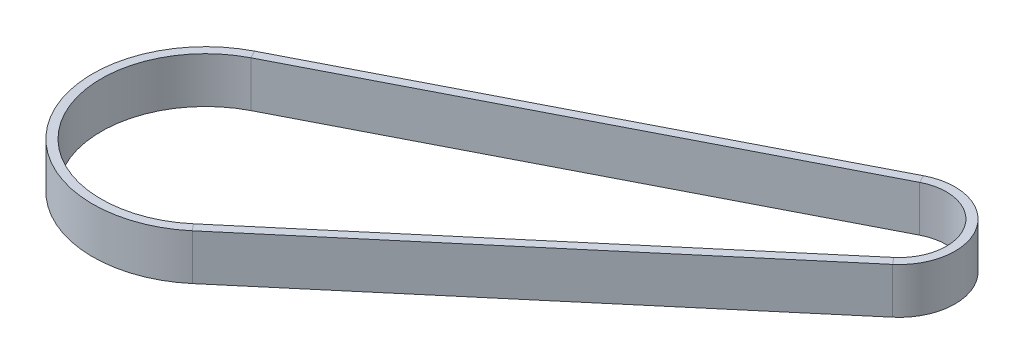
ISO-10303-21;
HEADER;
FILE_DESCRIPTION(('STEP AP214'),'2;1');
FILE_NAME('part.step','',(''),(''),'','','');
FILE_SCHEMA(('AUTOMOTIVE_DESIGN { 1 0 10303 214 1 1 1 1 }'));
ENDSEC;
DATA;
#1=APPLICATION_CONTEXT('core data for automotive mechanical design processes');
#2=APPLICATION_PROTOCOL_DEFINITION('international standard','automotive_design',2000,#1);
#3=PRODUCT_CONTEXT('',#1,'mechanical');
#4=PRODUCT('Part','Part','',(#3));
#5=PRODUCT_RELATED_PRODUCT_CATEGORY('part','',(#4));
#6=PRODUCT_DEFINITION_FORMATION('','',#4);
#7=PRODUCT_DEFINITION_CONTEXT('part definition',#1,'design');
#8=PRODUCT_DEFINITION('design','',#6,#7);
#9=PRODUCT_DEFINITION_SHAPE('','',#8);
#10=(LENGTH_UNIT() NAMED_UNIT(*) SI_UNIT(.MILLI.,.METRE.));
#11=(NAMED_UNIT(*) PLANE_ANGLE_UNIT() SI_UNIT($,.RADIAN.));
#12=(NAMED_UNIT(*) SI_UNIT($,.STERADIAN.) SOLID_ANGLE_UNIT());
#13=UNCERTAINTY_MEASURE_WITH_UNIT(LENGTH_MEASURE(1.E-05),#10,'distance_accuracy_value','');
#14=(GEOMETRIC_REPRESENTATION_CONTEXT(3) GLOBAL_UNCERTAINTY_ASSIGNED_CONTEXT((#13)) GLOBAL_UNIT_ASSIGNED_CONTEXT((#10,
#11,#12)) REPRESENTATION_CONTEXT('',''));
#15=CARTESIAN_POINT('',(0.,0.,0.));
#16=DIRECTION('',(0.,0.,1.));
#17=DIRECTION('',(1.,0.,0.));
#18=AXIS2_PLACEMENT_3D('',#15,#16,#17);
#19=CARTESIAN_POINT('',(147.327804985542,8.,-601.437174310357));
#20=DIRECTION('',(0.,1.,0.));
#21=DIRECTION('',(0.,0.,1.));
#22=AXIS2_PLACEMENT_3D('',#19,#20,#21);
#23=PLANE('',#22);
#24=DIRECTION('',(-0.763259885154289,0.,0.646091593904658));
#25=VECTOR('',#24,1.);
#26=CARTESIAN_POINT('',(149.266079767256,8.,-599.147394654894));
#27=LINE('',#26,#25);
#28=CARTESIAN_POINT('',(149.266079767255,8.,-599.147394654894));
#29=VERTEX_POINT('',#28);
#30=CARTESIAN_POINT('',(16.6145145170099,8.,-486.859217464561));
#31=VERTEX_POINT('',#30);
#32=EDGE_CURVE('E11',#29,#31,#27,.T.);
#33=ORIENTED_EDGE('',*,*,#32,.F.);
#34=DIRECTION('',(-0.646091593904662,0.,-0.763259885154286));
#35=VECTOR('',#34,1.);
#36=CARTESIAN_POINT('',(147.327804985541,8.,-601.437174310357));
#37=LINE('',#36,#35);
#38=CARTESIAN_POINT('',(147.327804985541,8.,-601.437174310357));
#39=VERTEX_POINT('',#38);
#40=EDGE_CURVE('E36',#29,#39,#37,.T.);
#41=ORIENTED_EDGE('',*,*,#40,.T.);
#42=DIRECTION('',(-0.763259885154289,0.,0.646091593904658));
#43=VECTOR('',#42,1.);
#44=CARTESIAN_POINT('',(147.327804985542,8.,-601.437174310357));
#45=LINE('',#44,#43);
#46=CARTESIAN_POINT('',(14.676239735296,8.,-489.148997120023));
#47=VERTEX_POINT('',#46);
#48=EDGE_CURVE('E112',#39,#47,#45,.T.);
#49=ORIENTED_EDGE('',*,*,#48,.T.);
#50=DIRECTION('',(-0.646091593904662,0.,-0.763259885154286));
#51=VECTOR('',#50,1.);
#52=CARTESIAN_POINT('',(14.676239735296,8.,-489.148997120023));
#53=LINE('',#52,#51);
#54=EDGE_CURVE('E115',#31,#47,#53,.T.);
#55=ORIENTED_EDGE('',*,*,#54,.F.);
#56=EDGE_LOOP('',(#33,#41,#49,#55));
#57=FACE_BOUND('',#56,.T.);
#58=ADVANCED_FACE('F33',(#57),#23,.T.);
#59=CARTESIAN_POINT('',(149.266079767256,8.,-599.147394654894));
#60=DIRECTION('',(0.646091593904658,0.,0.763259885154289));
#61=DIRECTION('',(0.763259885154289,0.,-0.646091593904658));
#62=AXIS2_PLACEMENT_3D('',#59,#60,#61);
#63=PLANE('',#62);
#64=DIRECTION('',(-0.763259885154289,0.,0.646091593904658));
#65=VECTOR('',#64,1.);
#66=CARTESIAN_POINT('',(149.266079767256,-8.,-599.147394654894));
#67=LINE('',#66,#65);
#68=CARTESIAN_POINT('',(149.266079767255,-8.,-599.147394654894));
#69=VERTEX_POINT('',#68);
#70=CARTESIAN_POINT('',(16.61451451701,-8.,-486.859217464561));
#71=VERTEX_POINT('',#70);
#72=EDGE_CURVE('E41',#69,#71,#67,.T.);
#73=ORIENTED_EDGE('',*,*,#72,.F.);
#74=DIRECTION('',(0.,1.,0.));
#75=VECTOR('',#74,1.);
#76=CARTESIAN_POINT('',(149.266079767255,8.,-599.147394654894));
#77=LINE('',#76,#75);
#78=EDGE_CURVE('E185',#69,#29,#77,.T.);
#79=ORIENTED_EDGE('',*,*,#78,.T.);
#80=ORIENTED_EDGE('',*,*,#32,.T.);
#81=DIRECTION('',(0.,1.,0.));
#82=VECTOR('',#81,1.);
#83=CARTESIAN_POINT('',(16.6145145170099,8.,-486.859217464561));
#84=LINE('',#83,#82);
#85=EDGE_CURVE('E139',#71,#31,#84,.T.);
#86=ORIENTED_EDGE('',*,*,#85,.F.);
#87=EDGE_LOOP('',(#73,#79,#80,#86));
#88=FACE_BOUND('',#87,.T.);
#89=ADVANCED_FACE('F224',(#88),#63,.T.);
#90=CARTESIAN_POINT('',(147.327804985542,-8.,-601.437174310357));
#91=DIRECTION('',(0.,-1.,0.));
#92=DIRECTION('',(0.,0.,-1.));
#93=AXIS2_PLACEMENT_3D('',#90,#91,#92);
#94=PLANE('',#93);
#95=DIRECTION('',(-0.763259885154289,0.,0.646091593904658));
#96=VECTOR('',#95,1.);
#97=CARTESIAN_POINT('',(147.327804985542,-8.,-601.437174310357));
#98=LINE('',#97,#96);
#99=CARTESIAN_POINT('',(147.327804985541,-8.,-601.437174310357));
#100=VERTEX_POINT('',#99);
#101=CARTESIAN_POINT('',(14.676239735296,-8.,-489.148997120023));
#102=VERTEX_POINT('',#101);
#103=EDGE_CURVE('E121',#100,#102,#98,.T.);
#104=ORIENTED_EDGE('',*,*,#103,.F.);
#105=DIRECTION('',(0.646091593904662,0.,0.763259885154286));
#106=VECTOR('',#105,1.);
#107=CARTESIAN_POINT('',(147.327804985541,-8.,-601.437174310357));
#108=LINE('',#107,#106);
#109=EDGE_CURVE('E166',#100,#69,#108,.T.);
#110=ORIENTED_EDGE('',*,*,#109,.T.);
#111=ORIENTED_EDGE('',*,*,#72,.T.);
#112=DIRECTION('',(0.646091593904662,0.,0.763259885154286));
#113=VECTOR('',#112,1.);
#114=CARTESIAN_POINT('',(14.676239735296,-8.,-489.148997120023));
#115=LINE('',#114,#113);
#116=EDGE_CURVE('E143',#102,#71,#115,.T.);
#117=ORIENTED_EDGE('',*,*,#116,.F.);
#118=EDGE_LOOP('',(#104,#110,#111,#117));
#119=FACE_BOUND('',#118,.T.);
#120=ADVANCED_FACE('F228',(#119),#94,.T.);
#121=CARTESIAN_POINT('',(129.146080361051,8.,-628.717056181918));
#122=DIRECTION('',(0.,1.,0.));
#123=DIRECTION('',(0.,0.,1.));
#124=AXIS2_PLACEMENT_3D('',#121,#122,#123);
#125=PLANE('',#124);
#126=ORIENTED_EDGE('',*,*,#40,.F.);
#127=CARTESIAN_POINT('',(136.667293686114,8.,-614.030962415403));
#128=DIRECTION('',(0.,-1.,0.));
#129=DIRECTION('',(-0.455831110609917,0.,-0.890066288879727));
#130=AXIS2_PLACEMENT_3D('',#127,#128,#129);
#131=CIRCLE('',#130,19.5000000000001);
#132=CARTESIAN_POINT('',(127.778587029221,8.,-631.387255048558));
#133=VERTEX_POINT('',#132);
#134=EDGE_CURVE('E194',#133,#29,#131,.T.);
#135=ORIENTED_EDGE('',*,*,#134,.F.);
#136=DIRECTION('',(0.45583111060992,0.,0.890066288879725));
#137=VECTOR('',#136,1.);
#138=CARTESIAN_POINT('',(129.146080361051,8.,-628.717056181918));
#139=LINE('',#138,#137);
#140=CARTESIAN_POINT('',(129.146080361051,8.,-628.717056181919));
#141=VERTEX_POINT('',#140);
#142=EDGE_CURVE('E169',#133,#141,#139,.T.);
#143=ORIENTED_EDGE('',*,*,#142,.T.);
#144=CARTESIAN_POINT('',(136.667293686114,8.,-614.030962415403));
#145=DIRECTION('',(0.,-1.,0.));
#146=DIRECTION('',(-0.455831110609918,0.,-0.890066288879726));
#147=AXIS2_PLACEMENT_3D('',#144,#145,#146);
#148=CIRCLE('',#147,16.5);
#149=EDGE_CURVE('E163',#141,#39,#148,.T.);
#150=ORIENTED_EDGE('',*,*,#149,.T.);
#151=EDGE_LOOP('',(#126,#135,#143,#150));
#152=FACE_BOUND('',#151,.T.);
#153=ADVANCED_FACE('F201',(#152),#125,.T.);
#154=CARTESIAN_POINT('',(136.667293686114,0.,-614.030962415403));
#155=DIRECTION('',(0.,-1.,0.));
#156=DIRECTION('',(0.,0.,-1.));
#157=AXIS2_PLACEMENT_3D('',#154,#155,#156);
#158=CYLINDRICAL_SURFACE('',#157,19.5000000000001);
#159=ORIENTED_EDGE('',*,*,#134,.T.);
#160=ORIENTED_EDGE('',*,*,#78,.F.);
#161=CARTESIAN_POINT('',(136.667293686114,-8.,-614.030962415403));
#162=DIRECTION('',(0.,-1.,0.));
#163=DIRECTION('',(-0.455831110609917,0.,-0.890066288879727));
#164=AXIS2_PLACEMENT_3D('',#161,#162,#163);
#165=CIRCLE('',#164,19.5000000000001);
#166=CARTESIAN_POINT('',(127.778587029221,-8.,-631.387255048558));
#167=VERTEX_POINT('',#166);
#168=EDGE_CURVE('E182',#167,#69,#165,.T.);
#169=ORIENTED_EDGE('',*,*,#168,.F.);
#170=DIRECTION('',(0.,1.,0.));
#171=VECTOR('',#170,1.);
#172=CARTESIAN_POINT('',(127.778587029221,8.,-631.387255048558));
#173=LINE('',#172,#171);
#174=EDGE_CURVE('E178',#167,#133,#173,.T.);
#175=ORIENTED_EDGE('',*,*,#174,.T.);
#176=EDGE_LOOP('',(#159,#160,#169,#175));
#177=FACE_BOUND('',#176,.T.);
#178=ADVANCED_FACE('F237',(#177),#158,.T.);
#179=CARTESIAN_POINT('',(129.146080361051,-8.,-628.717056181918));
#180=DIRECTION('',(0.,-1.,0.));
#181=DIRECTION('',(0.,0.,-1.));
#182=AXIS2_PLACEMENT_3D('',#179,#180,#181);
#183=PLANE('',#182);
#184=ORIENTED_EDGE('',*,*,#168,.T.);
#185=ORIENTED_EDGE('',*,*,#109,.F.);
#186=CARTESIAN_POINT('',(136.667293686114,-8.,-614.030962415403));
#187=DIRECTION('',(0.,-1.,0.));
#188=DIRECTION('',(-0.455831110609918,0.,-0.890066288879726));
#189=AXIS2_PLACEMENT_3D('',#186,#187,#188);
#190=CIRCLE('',#189,16.5);
#191=CARTESIAN_POINT('',(129.146080361051,-8.,-628.717056181919));
#192=VERTEX_POINT('',#191);
#193=EDGE_CURVE('E162',#192,#100,#190,.T.);
#194=ORIENTED_EDGE('',*,*,#193,.F.);
#195=DIRECTION('',(-0.45583111060992,0.,-0.890066288879725));
#196=VECTOR('',#195,1.);
#197=CARTESIAN_POINT('',(129.146080361051,-8.,-628.717056181918));
#198=LINE('',#197,#196);
#199=EDGE_CURVE('E155',#192,#167,#198,.T.);
#200=ORIENTED_EDGE('',*,*,#199,.T.);
#201=EDGE_LOOP('',(#184,#185,#194,#200));
#202=FACE_BOUND('',#201,.T.);
#203=ADVANCED_FACE('F209',(#202),#183,.T.);
#204=CARTESIAN_POINT('',(136.667293686114,0.,-614.030962415403));
#205=DIRECTION('',(0.,-1.,0.));
#206=DIRECTION('',(0.,0.,-1.));
#207=AXIS2_PLACEMENT_3D('',#204,#205,#206);
#208=CYLINDRICAL_SURFACE('',#207,16.5);
#209=ORIENTED_EDGE('',*,*,#193,.T.);
#210=DIRECTION('',(0.,-1.,0.));
#211=VECTOR('',#210,1.);
#212=CARTESIAN_POINT('',(147.327804985541,8.,-601.437174310357));
#213=LINE('',#212,#211);
#214=EDGE_CURVE('E160',#39,#100,#213,.T.);
#215=ORIENTED_EDGE('',*,*,#214,.F.);
#216=ORIENTED_EDGE('',*,*,#149,.F.);
#217=DIRECTION('',(0.,-1.,0.));
#218=VECTOR('',#217,1.);
#219=CARTESIAN_POINT('',(129.146080361051,8.,-628.717056181918));
#220=LINE('',#219,#218);
#221=EDGE_CURVE('E152',#141,#192,#220,.T.);
#222=ORIENTED_EDGE('',*,*,#221,.T.);
#223=EDGE_LOOP('',(#209,#215,#216,#222));
#224=FACE_BOUND('',#223,.T.);
#225=ADVANCED_FACE('F206',(#224),#208,.F.);
#226=CARTESIAN_POINT('',(-25.5439389794861,8.,-549.495402472265));
#227=DIRECTION('',(0.,1.,0.));
#228=DIRECTION('',(0.,0.,1.));
#229=AXIS2_PLACEMENT_3D('',#226,#227,#228);
#230=PLANE('',#229);
#231=ORIENTED_EDGE('',*,*,#142,.F.);
#232=DIRECTION('',(0.890066288879728,0.,-0.455831110609915));
#233=VECTOR('',#232,1.);
#234=CARTESIAN_POINT('',(-26.9114323113159,8.,-552.165601338904));
#235=LINE('',#234,#233);
#236=CARTESIAN_POINT('',(-26.9114323113159,8.,-552.165601338904));
#237=VERTEX_POINT('',#236);
#238=EDGE_CURVE('E77',#237,#133,#235,.T.);
#239=ORIENTED_EDGE('',*,*,#238,.F.);
#240=DIRECTION('',(0.455831110609922,0.,0.890066288879725));
#241=VECTOR('',#240,1.);
#242=CARTESIAN_POINT('',(-25.5439389794861,8.,-549.495402472265));
#243=LINE('',#242,#241);
#244=CARTESIAN_POINT('',(-25.5439389794862,8.,-549.495402472265));
#245=VERTEX_POINT('',#244);
#246=EDGE_CURVE('E159',#237,#245,#243,.T.);
#247=ORIENTED_EDGE('',*,*,#246,.T.);
#248=DIRECTION('',(0.890066288879728,0.,-0.455831110609915));
#249=VECTOR('',#248,1.);
#250=CARTESIAN_POINT('',(-25.5439389794861,8.,-549.495402472265));
#251=LINE('',#250,#249);
#252=EDGE_CURVE('E157',#245,#141,#251,.T.);
#253=ORIENTED_EDGE('',*,*,#252,.T.);
#254=EDGE_LOOP('',(#231,#239,#247,#253));
#255=FACE_BOUND('',#254,.T.);
#256=ADVANCED_FACE('F219',(#255),#230,.T.);
#257=CARTESIAN_POINT('',(-26.9114323113159,8.,-552.165601338904));
#258=DIRECTION('',(-0.455831110609915,0.,-0.890066288879728));
#259=DIRECTION('',(-0.890066288879728,0.,0.455831110609915));
#260=AXIS2_PLACEMENT_3D('',#257,#258,#259);
#261=PLANE('',#260);
#262=ORIENTED_EDGE('',*,*,#238,.T.);
#263=ORIENTED_EDGE('',*,*,#174,.F.);
#264=DIRECTION('',(0.890066288879728,0.,-0.455831110609915));
#265=VECTOR('',#264,1.);
#266=CARTESIAN_POINT('',(-26.9114323113159,-8.,-552.165601338904));
#267=LINE('',#266,#265);
#268=CARTESIAN_POINT('',(-26.9114323113159,-8.,-552.165601338904));
#269=VERTEX_POINT('',#268);
#270=EDGE_CURVE('E87',#269,#167,#267,.T.);
#271=ORIENTED_EDGE('',*,*,#270,.F.);
#272=DIRECTION('',(0.,1.,0.));
#273=VECTOR('',#272,1.);
#274=CARTESIAN_POINT('',(-26.9114323113158,8.,-552.165601338904));
#275=LINE('',#274,#273);
#276=EDGE_CURVE('E175',#269,#237,#275,.T.);
#277=ORIENTED_EDGE('',*,*,#276,.T.);
#278=EDGE_LOOP('',(#262,#263,#271,#277));
#279=FACE_BOUND('',#278,.T.);
#280=ADVANCED_FACE('F212',(#279),#261,.T.);
#281=CARTESIAN_POINT('',(-25.5439389794861,-8.,-549.495402472265));
#282=DIRECTION('',(0.,-1.,0.));
#283=DIRECTION('',(0.,0.,-1.));
#284=AXIS2_PLACEMENT_3D('',#281,#282,#283);
#285=PLANE('',#284);
#286=ORIENTED_EDGE('',*,*,#270,.T.);
#287=ORIENTED_EDGE('',*,*,#199,.F.);
#288=DIRECTION('',(0.890066288879728,0.,-0.455831110609915));
#289=VECTOR('',#288,1.);
#290=CARTESIAN_POINT('',(-25.5439389794861,-8.,-549.495402472265));
#291=LINE('',#290,#289);
#292=CARTESIAN_POINT('',(-25.5439389794862,-8.,-549.495402472265));
#293=VERTEX_POINT('',#292);
#294=EDGE_CURVE('E95',#293,#192,#291,.T.);
#295=ORIENTED_EDGE('',*,*,#294,.F.);
#296=DIRECTION('',(-0.455831110609922,0.,-0.890066288879725));
#297=VECTOR('',#296,1.);
#298=CARTESIAN_POINT('',(-25.5439389794861,-8.,-549.495402472265));
#299=LINE('',#298,#297);
#300=EDGE_CURVE('E150',#293,#269,#299,.T.);
#301=ORIENTED_EDGE('',*,*,#300,.T.);
#302=EDGE_LOOP('',(#286,#287,#295,#301));
#303=FACE_BOUND('',#302,.T.);
#304=ADVANCED_FACE('F210',(#303),#285,.T.);
#305=CARTESIAN_POINT('',(-25.5439389794861,8.,-549.495402472265));
#306=DIRECTION('',(0.455831110609915,0.,0.890066288879728));
#307=DIRECTION('',(0.890066288879728,0.,-0.455831110609915));
#308=AXIS2_PLACEMENT_3D('',#305,#306,#307);
#309=PLANE('',#308);
#310=ORIENTED_EDGE('',*,*,#294,.T.);
#311=ORIENTED_EDGE('',*,*,#221,.F.);
#312=ORIENTED_EDGE('',*,*,#252,.F.);
#313=DIRECTION('',(0.,-1.,0.));
#314=VECTOR('',#313,1.);
#315=CARTESIAN_POINT('',(-25.5439389794861,8.,-549.495402472265));
#316=LINE('',#315,#314);
#317=EDGE_CURVE('E131',#245,#293,#316,.T.);
#318=ORIENTED_EDGE('',*,*,#317,.T.);
#319=EDGE_LOOP('',(#310,#311,#312,#318));
#320=FACE_BOUND('',#319,.T.);
#321=ADVANCED_FACE('F204',(#320),#309,.T.);
#322=CARTESIAN_POINT('',(14.676239735296,8.,-489.148997120023));
#323=DIRECTION('',(0.,1.,0.));
#324=DIRECTION('',(0.,0.,1.));
#325=AXIS2_PLACEMENT_3D('',#322,#323,#324);
#326=PLANE('',#325);
#327=ORIENTED_EDGE('',*,*,#246,.F.);
#328=CARTESIAN_POINT('',(-8.9061034422241,8.,-517.007982928155));
#329=DIRECTION('',(0.,-1.,0.));
#330=DIRECTION('',(0.646091593904658,0.,0.763259885154289));
#331=AXIS2_PLACEMENT_3D('',#328,#329,#330);
#332=CIRCLE('',#331,39.5000000000001);
#333=EDGE_CURVE('E138',#31,#237,#332,.T.);
#334=ORIENTED_EDGE('',*,*,#333,.F.);
#335=ORIENTED_EDGE('',*,*,#54,.T.);
#336=CARTESIAN_POINT('',(-8.9061034422241,8.,-517.007982928155));
#337=DIRECTION('',(0.,-1.,0.));
#338=DIRECTION('',(0.646091593904658,0.,0.763259885154289));
#339=AXIS2_PLACEMENT_3D('',#336,#337,#338);
#340=CIRCLE('',#339,36.5000000000001);
#341=EDGE_CURVE('E127',#47,#245,#340,.T.);
#342=ORIENTED_EDGE('',*,*,#341,.T.);
#343=EDGE_LOOP('',(#327,#334,#335,#342));
#344=FACE_BOUND('',#343,.T.);
#345=ADVANCED_FACE('F136',(#344),#326,.T.);
#346=CARTESIAN_POINT('',(-8.9061034422241,0.,-517.007982928155));
#347=DIRECTION('',(0.,-1.,0.));
#348=DIRECTION('',(0.,0.,-1.));
#349=AXIS2_PLACEMENT_3D('',#346,#347,#348);
#350=CYLINDRICAL_SURFACE('',#349,39.5000000000001);
#351=ORIENTED_EDGE('',*,*,#333,.T.);
#352=ORIENTED_EDGE('',*,*,#276,.F.);
#353=CARTESIAN_POINT('',(-8.9061034422241,-8.,-517.007982928155));
#354=DIRECTION('',(0.,-1.,0.));
#355=DIRECTION('',(0.646091593904658,0.,0.763259885154289));
#356=AXIS2_PLACEMENT_3D('',#353,#354,#355);
#357=CIRCLE('',#356,39.5000000000001);
#358=EDGE_CURVE('E172',#71,#269,#357,.T.);
#359=ORIENTED_EDGE('',*,*,#358,.F.);
#360=ORIENTED_EDGE('',*,*,#85,.T.);
#361=EDGE_LOOP('',(#351,#352,#359,#360));
#362=FACE_BOUND('',#361,.T.);
#363=ADVANCED_FACE('F240',(#362),#350,.T.);
#364=CARTESIAN_POINT('',(14.676239735296,-8.,-489.148997120023));
#365=DIRECTION('',(0.,-1.,0.));
#366=DIRECTION('',(0.,0.,-1.));
#367=AXIS2_PLACEMENT_3D('',#364,#365,#366);
#368=PLANE('',#367);
#369=ORIENTED_EDGE('',*,*,#358,.T.);
#370=ORIENTED_EDGE('',*,*,#300,.F.);
#371=CARTESIAN_POINT('',(-8.9061034422241,-8.,-517.007982928155));
#372=DIRECTION('',(0.,-1.,0.));
#373=DIRECTION('',(0.646091593904658,0.,0.763259885154289));
#374=AXIS2_PLACEMENT_3D('',#371,#372,#373);
#375=CIRCLE('',#374,36.5000000000001);
#376=EDGE_CURVE('E149',#102,#293,#375,.T.);
#377=ORIENTED_EDGE('',*,*,#376,.F.);
#378=ORIENTED_EDGE('',*,*,#116,.T.);
#379=EDGE_LOOP('',(#369,#370,#377,#378));
#380=FACE_BOUND('',#379,.T.);
#381=ADVANCED_FACE('F254',(#380),#368,.T.);
#382=CARTESIAN_POINT('',(-8.9061034422241,0.,-517.007982928155));
#383=DIRECTION('',(0.,-1.,0.));
#384=DIRECTION('',(0.,0.,-1.));
#385=AXIS2_PLACEMENT_3D('',#382,#383,#384);
#386=CYLINDRICAL_SURFACE('',#385,36.5000000000001);
#387=ORIENTED_EDGE('',*,*,#376,.T.);
#388=ORIENTED_EDGE('',*,*,#317,.F.);
#389=ORIENTED_EDGE('',*,*,#341,.F.);
#390=DIRECTION('',(0.,-1.,0.));
#391=VECTOR('',#390,1.);
#392=CARTESIAN_POINT('',(14.676239735296,8.,-489.148997120023));
#393=LINE('',#392,#391);
#394=EDGE_CURVE('E130',#47,#102,#393,.T.);
#395=ORIENTED_EDGE('',*,*,#394,.T.);
#396=EDGE_LOOP('',(#387,#388,#389,#395));
#397=FACE_BOUND('',#396,.T.);
#398=ADVANCED_FACE('F129',(#397),#386,.F.);
#399=CARTESIAN_POINT('',(147.327804985542,8.,-601.437174310357));
#400=DIRECTION('',(-0.646091593904658,0.,-0.763259885154289));
#401=DIRECTION('',(-0.763259885154289,0.,0.646091593904658));
#402=AXIS2_PLACEMENT_3D('',#399,#400,#401);
#403=PLANE('',#402);
#404=ORIENTED_EDGE('',*,*,#214,.T.);
#405=ORIENTED_EDGE('',*,*,#103,.T.);
#406=ORIENTED_EDGE('',*,*,#394,.F.);
#407=ORIENTED_EDGE('',*,*,#48,.F.);
#408=EDGE_LOOP('',(#404,#405,#406,#407));
#409=FACE_BOUND('',#408,.T.);
#410=ADVANCED_FACE('F141',(#409),#403,.T.);
#411=CLOSED_SHELL('',(#58,#89,#120,#153,#178,#203,#225,#256,#280,#304,#321,#345,#363,#381,#398,#410));
#412=MANIFOLD_SOLID_BREP('B2',#411);
#413=ADVANCED_BREP_SHAPE_REPRESENTATION('',(#18,#412),#14);
#414=SHAPE_DEFINITION_REPRESENTATION(#9,#413);
ENDSEC;
END-ISO-10303-21;
